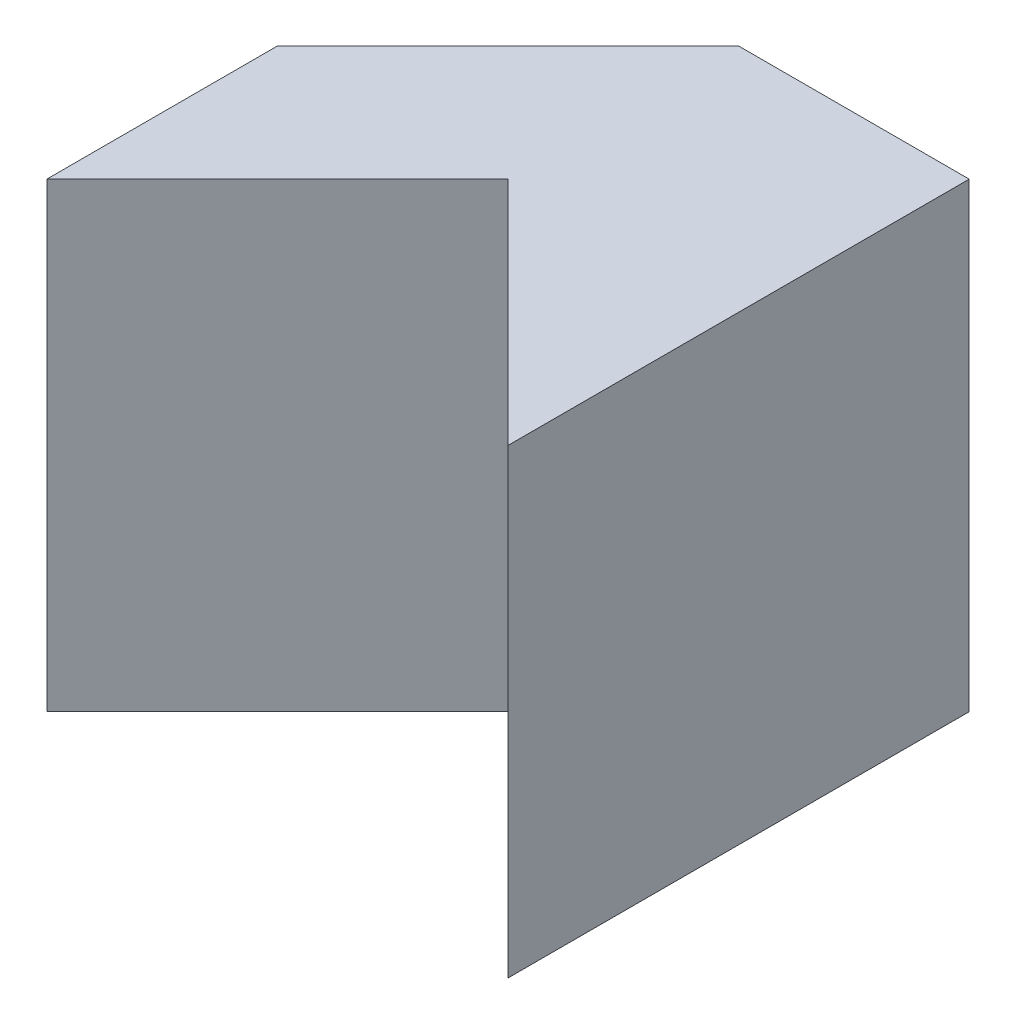
ISO-10303-21;
HEADER;
FILE_DESCRIPTION(('STEP AP214'),'2;1');
FILE_NAME('part.step','',(''),(''),'','','');
FILE_SCHEMA(('AUTOMOTIVE_DESIGN { 1 0 10303 214 1 1 1 1 }'));
ENDSEC;
DATA;
#1=APPLICATION_CONTEXT('core data for automotive mechanical design processes');
#2=APPLICATION_PROTOCOL_DEFINITION('international standard','automotive_design',2000,#1);
#3=PRODUCT_CONTEXT('',#1,'mechanical');
#4=PRODUCT('Part','Part','',(#3));
#5=PRODUCT_RELATED_PRODUCT_CATEGORY('part','',(#4));
#6=PRODUCT_DEFINITION_FORMATION('','',#4);
#7=PRODUCT_DEFINITION_CONTEXT('part definition',#1,'design');
#8=PRODUCT_DEFINITION('design','',#6,#7);
#9=PRODUCT_DEFINITION_SHAPE('','',#8);
#10=(LENGTH_UNIT() NAMED_UNIT(*) SI_UNIT(.MILLI.,.METRE.));
#11=(NAMED_UNIT(*) PLANE_ANGLE_UNIT() SI_UNIT($,.RADIAN.));
#12=(NAMED_UNIT(*) SI_UNIT($,.STERADIAN.) SOLID_ANGLE_UNIT());
#13=UNCERTAINTY_MEASURE_WITH_UNIT(LENGTH_MEASURE(1.E-05),#10,'distance_accuracy_value','');
#14=(GEOMETRIC_REPRESENTATION_CONTEXT(3) GLOBAL_UNCERTAINTY_ASSIGNED_CONTEXT((#13)) GLOBAL_UNIT_ASSIGNED_CONTEXT((#10,
#11,#12)) REPRESENTATION_CONTEXT('',''));
#15=CARTESIAN_POINT('',(0.,0.,0.));
#16=DIRECTION('',(0.,0.,1.));
#17=DIRECTION('',(1.,0.,0.));
#18=AXIS2_PLACEMENT_3D('',#15,#16,#17);
#19=CARTESIAN_POINT('',(0.,0.,20.));
#20=DIRECTION('',(1.,0.,0.));
#21=DIRECTION('',(0.,0.,-1.));
#22=AXIS2_PLACEMENT_3D('',#19,#20,#21);
#23=PLANE('',#22);
#24=DIRECTION('',(0.,0.,-1.));
#25=VECTOR('',#24,1.);
#26=CARTESIAN_POINT('',(0.,20.,20.));
#27=LINE('',#26,#25);
#28=CARTESIAN_POINT('',(0.,20.,20.));
#29=VERTEX_POINT('',#28);
#30=CARTESIAN_POINT('',(0.,20.,10.));
#31=VERTEX_POINT('',#30);
#32=EDGE_CURVE('E121',#29,#31,#27,.T.);
#33=ORIENTED_EDGE('',*,*,#32,.T.);
#34=DIRECTION('',(0.,1.,0.));
#35=VECTOR('',#34,1.);
#36=CARTESIAN_POINT('',(0.,0.,10.));
#37=LINE('',#36,#35);
#38=CARTESIAN_POINT('',(0.,0.,10.));
#39=VERTEX_POINT('',#38);
#40=EDGE_CURVE('E113',#39,#31,#37,.T.);
#41=ORIENTED_EDGE('',*,*,#40,.F.);
#42=DIRECTION('',(0.,0.,-1.));
#43=VECTOR('',#42,1.);
#44=CARTESIAN_POINT('',(0.,0.,20.));
#45=LINE('',#44,#43);
#46=CARTESIAN_POINT('',(0.,0.,20.));
#47=VERTEX_POINT('',#46);
#48=EDGE_CURVE('E11',#47,#39,#45,.T.);
#49=ORIENTED_EDGE('',*,*,#48,.F.);
#50=DIRECTION('',(0.,-1.,0.));
#51=VECTOR('',#50,1.);
#52=CARTESIAN_POINT('',(0.,0.,20.));
#53=LINE('',#52,#51);
#54=EDGE_CURVE('E101',#29,#47,#53,.T.);
#55=ORIENTED_EDGE('',*,*,#54,.F.);
#56=EDGE_LOOP('',(#33,#41,#49,#55));
#57=FACE_BOUND('',#56,.T.);
#58=ADVANCED_FACE('F33',(#57),#23,.F.);
#59=CARTESIAN_POINT('',(0.,0.,20.));
#60=DIRECTION('',(0.,1.,0.));
#61=DIRECTION('',(0.,0.,1.));
#62=AXIS2_PLACEMENT_3D('',#59,#60,#61);
#63=PLANE('',#62);
#64=DIRECTION('',(-0.707106781186548,0.,-0.707106781186547));
#65=VECTOR('',#64,1.);
#66=CARTESIAN_POINT('',(20.,0.,20.));
#67=LINE('',#66,#65);
#68=CARTESIAN_POINT('',(20.,0.,20.));
#69=VERTEX_POINT('',#68);
#70=CARTESIAN_POINT('',(10.,0.,10.));
#71=VERTEX_POINT('',#70);
#72=EDGE_CURVE('E56',#69,#71,#67,.T.);
#73=ORIENTED_EDGE('',*,*,#72,.T.);
#74=DIRECTION('',(-0.707106781186548,0.,0.707106781186547));
#75=VECTOR('',#74,1.);
#76=CARTESIAN_POINT('',(10.,0.,10.));
#77=LINE('',#76,#75);
#78=EDGE_CURVE('E96',#71,#47,#77,.T.);
#79=ORIENTED_EDGE('',*,*,#78,.T.);
#80=ORIENTED_EDGE('',*,*,#48,.T.);
#81=DIRECTION('',(0.707106781186548,0.,-0.707106781186548));
#82=VECTOR('',#81,1.);
#83=CARTESIAN_POINT('',(10.,0.,0.));
#84=LINE('',#83,#82);
#85=CARTESIAN_POINT('',(10.,0.,0.));
#86=VERTEX_POINT('',#85);
#87=EDGE_CURVE('E111',#39,#86,#84,.T.);
#88=ORIENTED_EDGE('',*,*,#87,.T.);
#89=DIRECTION('',(1.,0.,0.));
#90=VECTOR('',#89,1.);
#91=CARTESIAN_POINT('',(0.,0.,0.));
#92=LINE('',#91,#90);
#93=CARTESIAN_POINT('',(20.,0.,0.));
#94=VERTEX_POINT('',#93);
#95=EDGE_CURVE('E69',#86,#94,#92,.T.);
#96=ORIENTED_EDGE('',*,*,#95,.T.);
#97=DIRECTION('',(0.,0.,-1.));
#98=VECTOR('',#97,1.);
#99=CARTESIAN_POINT('',(20.,0.,20.));
#100=LINE('',#99,#98);
#101=EDGE_CURVE('E40',#69,#94,#100,.T.);
#102=ORIENTED_EDGE('',*,*,#101,.F.);
#103=EDGE_LOOP('',(#73,#79,#80,#88,#96,#102));
#104=FACE_BOUND('',#103,.T.);
#105=ADVANCED_FACE('F104',(#104),#63,.F.);
#106=CARTESIAN_POINT('',(20.,0.,20.));
#107=DIRECTION('',(-1.,0.,0.));
#108=DIRECTION('',(0.,0.,1.));
#109=AXIS2_PLACEMENT_3D('',#106,#107,#108);
#110=PLANE('',#109);
#111=DIRECTION('',(0.,1.,0.));
#112=VECTOR('',#111,1.);
#113=CARTESIAN_POINT('',(20.,0.,0.));
#114=LINE('',#113,#112);
#115=CARTESIAN_POINT('',(20.,20.,0.));
#116=VERTEX_POINT('',#115);
#117=EDGE_CURVE('E123',#94,#116,#114,.T.);
#118=ORIENTED_EDGE('',*,*,#117,.T.);
#119=DIRECTION('',(0.,0.,-1.));
#120=VECTOR('',#119,1.);
#121=CARTESIAN_POINT('',(20.,20.,20.));
#122=LINE('',#121,#120);
#123=CARTESIAN_POINT('',(20.,20.,20.));
#124=VERTEX_POINT('',#123);
#125=EDGE_CURVE('E129',#124,#116,#122,.T.);
#126=ORIENTED_EDGE('',*,*,#125,.F.);
#127=DIRECTION('',(0.,1.,0.));
#128=VECTOR('',#127,1.);
#129=CARTESIAN_POINT('',(20.,0.,20.));
#130=LINE('',#129,#128);
#131=EDGE_CURVE('E118',#69,#124,#130,.T.);
#132=ORIENTED_EDGE('',*,*,#131,.F.);
#133=ORIENTED_EDGE('',*,*,#101,.T.);
#134=EDGE_LOOP('',(#118,#126,#132,#133));
#135=FACE_BOUND('',#134,.T.);
#136=ADVANCED_FACE('F133',(#135),#110,.F.);
#137=CARTESIAN_POINT('',(0.,20.,20.));
#138=DIRECTION('',(0.,-1.,0.));
#139=DIRECTION('',(0.,0.,-1.));
#140=AXIS2_PLACEMENT_3D('',#137,#138,#139);
#141=PLANE('',#140);
#142=ORIENTED_EDGE('',*,*,#32,.F.);
#143=DIRECTION('',(-0.707106781186548,0.,0.707106781186547));
#144=VECTOR('',#143,1.);
#145=CARTESIAN_POINT('',(10.,20.,10.));
#146=LINE('',#145,#144);
#147=CARTESIAN_POINT('',(10.,20.,10.));
#148=VERTEX_POINT('',#147);
#149=EDGE_CURVE('E106',#148,#29,#146,.T.);
#150=ORIENTED_EDGE('',*,*,#149,.F.);
#151=DIRECTION('',(-0.707106781186548,0.,-0.707106781186547));
#152=VECTOR('',#151,1.);
#153=CARTESIAN_POINT('',(20.,20.,20.));
#154=LINE('',#153,#152);
#155=EDGE_CURVE('E93',#124,#148,#154,.T.);
#156=ORIENTED_EDGE('',*,*,#155,.F.);
#157=ORIENTED_EDGE('',*,*,#125,.T.);
#158=DIRECTION('',(-1.,0.,0.));
#159=VECTOR('',#158,1.);
#160=CARTESIAN_POINT('',(0.,20.,0.));
#161=LINE('',#160,#159);
#162=CARTESIAN_POINT('',(10.,20.,0.));
#163=VERTEX_POINT('',#162);
#164=EDGE_CURVE('E119',#116,#163,#161,.T.);
#165=ORIENTED_EDGE('',*,*,#164,.T.);
#166=DIRECTION('',(0.707106781186548,0.,-0.707106781186548));
#167=VECTOR('',#166,1.);
#168=CARTESIAN_POINT('',(10.,20.,0.));
#169=LINE('',#168,#167);
#170=EDGE_CURVE('E47',#31,#163,#169,.T.);
#171=ORIENTED_EDGE('',*,*,#170,.F.);
#172=EDGE_LOOP('',(#142,#150,#156,#157,#165,#171));
#173=FACE_BOUND('',#172,.T.);
#174=ADVANCED_FACE('F140',(#173),#141,.F.);
#175=CARTESIAN_POINT('',(0.,0.,0.));
#176=DIRECTION('',(0.,0.,-1.));
#177=DIRECTION('',(-1.,0.,0.));
#178=AXIS2_PLACEMENT_3D('',#175,#176,#177);
#179=PLANE('',#178);
#180=DIRECTION('',(0.,1.,0.));
#181=VECTOR('',#180,1.);
#182=CARTESIAN_POINT('',(10.,0.,0.));
#183=LINE('',#182,#181);
#184=EDGE_CURVE('E73',#86,#163,#183,.T.);
#185=ORIENTED_EDGE('',*,*,#184,.T.);
#186=ORIENTED_EDGE('',*,*,#164,.F.);
#187=ORIENTED_EDGE('',*,*,#117,.F.);
#188=ORIENTED_EDGE('',*,*,#95,.F.);
#189=EDGE_LOOP('',(#185,#186,#187,#188));
#190=FACE_BOUND('',#189,.T.);
#191=ADVANCED_FACE('F137',(#190),#179,.T.);
#192=CARTESIAN_POINT('',(10.,0.,0.));
#193=DIRECTION('',(0.707106781186548,0.,0.707106781186548));
#194=DIRECTION('',(0.707106781186548,0.,-0.707106781186548));
#195=AXIS2_PLACEMENT_3D('',#192,#193,#194);
#196=PLANE('',#195);
#197=ORIENTED_EDGE('',*,*,#170,.T.);
#198=ORIENTED_EDGE('',*,*,#184,.F.);
#199=ORIENTED_EDGE('',*,*,#87,.F.);
#200=ORIENTED_EDGE('',*,*,#40,.T.);
#201=EDGE_LOOP('',(#197,#198,#199,#200));
#202=FACE_BOUND('',#201,.T.);
#203=ADVANCED_FACE('F143',(#202),#196,.F.);
#204=CARTESIAN_POINT('',(10.,0.,10.));
#205=DIRECTION('',(-0.707106781186547,0.,-0.707106781186548));
#206=DIRECTION('',(-0.707106781186548,0.,0.707106781186547));
#207=AXIS2_PLACEMENT_3D('',#204,#205,#206);
#208=PLANE('',#207);
#209=ORIENTED_EDGE('',*,*,#149,.T.);
#210=ORIENTED_EDGE('',*,*,#54,.T.);
#211=ORIENTED_EDGE('',*,*,#78,.F.);
#212=DIRECTION('',(0.,1.,0.));
#213=VECTOR('',#212,1.);
#214=CARTESIAN_POINT('',(10.,0.,10.));
#215=LINE('',#214,#213);
#216=EDGE_CURVE('E89',#71,#148,#215,.T.);
#217=ORIENTED_EDGE('',*,*,#216,.T.);
#218=EDGE_LOOP('',(#209,#210,#211,#217));
#219=FACE_BOUND('',#218,.T.);
#220=ADVANCED_FACE('F99',(#219),#208,.F.);
#221=CARTESIAN_POINT('',(20.,0.,20.));
#222=DIRECTION('',(0.707106781186547,0.,-0.707106781186548));
#223=DIRECTION('',(-0.707106781186548,0.,-0.707106781186547));
#224=AXIS2_PLACEMENT_3D('',#221,#222,#223);
#225=PLANE('',#224);
#226=ORIENTED_EDGE('',*,*,#155,.T.);
#227=ORIENTED_EDGE('',*,*,#216,.F.);
#228=ORIENTED_EDGE('',*,*,#72,.F.);
#229=ORIENTED_EDGE('',*,*,#131,.T.);
#230=EDGE_LOOP('',(#226,#227,#228,#229));
#231=FACE_BOUND('',#230,.T.);
#232=ADVANCED_FACE('F91',(#231),#225,.F.);
#233=CLOSED_SHELL('',(#58,#105,#136,#174,#191,#203,#220,#232));
#234=MANIFOLD_SOLID_BREP('B2',#233);
#235=ADVANCED_BREP_SHAPE_REPRESENTATION('',(#18,#234),#14);
#236=SHAPE_DEFINITION_REPRESENTATION(#9,#235);
ENDSEC;
END-ISO-10303-21;
